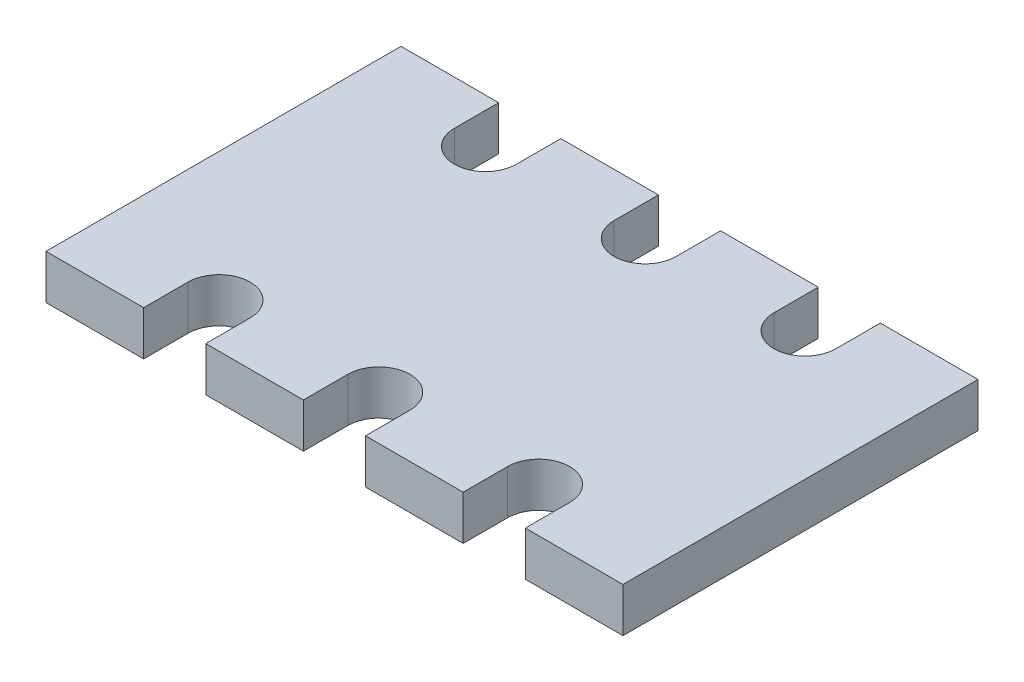
ISO-10303-21;
HEADER;
FILE_DESCRIPTION(('STEP AP214'),'2;1');
FILE_NAME('part.step','',(''),(''),'','','');
FILE_SCHEMA(('AUTOMOTIVE_DESIGN { 1 0 10303 214 1 1 1 1 }'));
ENDSEC;
DATA;
#1=APPLICATION_CONTEXT('core data for automotive mechanical design processes');
#2=APPLICATION_PROTOCOL_DEFINITION('international standard','automotive_design',2000,#1);
#3=PRODUCT_CONTEXT('',#1,'mechanical');
#4=PRODUCT('Part','Part','',(#3));
#5=PRODUCT_RELATED_PRODUCT_CATEGORY('part','',(#4));
#6=PRODUCT_DEFINITION_FORMATION('','',#4);
#7=PRODUCT_DEFINITION_CONTEXT('part definition',#1,'design');
#8=PRODUCT_DEFINITION('design','',#6,#7);
#9=PRODUCT_DEFINITION_SHAPE('','',#8);
#10=(LENGTH_UNIT() NAMED_UNIT(*) SI_UNIT(.MILLI.,.METRE.));
#11=(NAMED_UNIT(*) PLANE_ANGLE_UNIT() SI_UNIT($,.RADIAN.));
#12=(NAMED_UNIT(*) SI_UNIT($,.STERADIAN.) SOLID_ANGLE_UNIT());
#13=UNCERTAINTY_MEASURE_WITH_UNIT(LENGTH_MEASURE(1.E-05),#10,'distance_accuracy_value','');
#14=(GEOMETRIC_REPRESENTATION_CONTEXT(3) GLOBAL_UNCERTAINTY_ASSIGNED_CONTEXT((#13)) GLOBAL_UNIT_ASSIGNED_CONTEXT((#10,
#11,#12)) REPRESENTATION_CONTEXT('',''));
#15=CARTESIAN_POINT('',(0.,0.,0.));
#16=DIRECTION('',(0.,0.,1.));
#17=DIRECTION('',(1.,0.,0.));
#18=AXIS2_PLACEMENT_3D('',#15,#16,#17);
#19=CARTESIAN_POINT('',(0.,0.5,0.));
#20=DIRECTION('',(-1.,0.,0.));
#21=DIRECTION('',(0.,0.,1.));
#22=AXIS2_PLACEMENT_3D('',#19,#20,#21);
#23=PLANE('',#22);
#24=DIRECTION('',(0.,0.,-1.));
#25=VECTOR('',#24,1.);
#26=CARTESIAN_POINT('',(0.,0.,0.));
#27=LINE('',#26,#25);
#28=CARTESIAN_POINT('',(0.,0.,4.));
#29=VERTEX_POINT('',#28);
#30=CARTESIAN_POINT('',(0.,0.,0.));
#31=VERTEX_POINT('',#30);
#32=EDGE_CURVE('E252',#29,#31,#27,.T.);
#33=ORIENTED_EDGE('',*,*,#32,.T.);
#34=DIRECTION('',(0.,-1.,0.));
#35=VECTOR('',#34,1.);
#36=CARTESIAN_POINT('',(0.,0.5,0.));
#37=LINE('',#36,#35);
#38=CARTESIAN_POINT('',(0.,0.5,0.));
#39=VERTEX_POINT('',#38);
#40=EDGE_CURVE('E11',#39,#31,#37,.T.);
#41=ORIENTED_EDGE('',*,*,#40,.F.);
#42=DIRECTION('',(0.,0.,-1.));
#43=VECTOR('',#42,1.);
#44=CARTESIAN_POINT('',(0.,0.5,0.));
#45=LINE('',#44,#43);
#46=CARTESIAN_POINT('',(0.,0.5,4.));
#47=VERTEX_POINT('',#46);
#48=EDGE_CURVE('E306',#47,#39,#45,.T.);
#49=ORIENTED_EDGE('',*,*,#48,.F.);
#50=DIRECTION('',(0.,-1.,0.));
#51=VECTOR('',#50,1.);
#52=CARTESIAN_POINT('',(0.,0.5,4.));
#53=LINE('',#52,#51);
#54=EDGE_CURVE('E248',#47,#29,#53,.T.);
#55=ORIENTED_EDGE('',*,*,#54,.T.);
#56=EDGE_LOOP('',(#33,#41,#49,#55));
#57=FACE_BOUND('',#56,.T.);
#58=ADVANCED_FACE('F36',(#57),#23,.F.);
#59=CARTESIAN_POINT('',(0.,0.5,0.));
#60=DIRECTION('',(0.,0.,1.));
#61=DIRECTION('',(1.,0.,0.));
#62=AXIS2_PLACEMENT_3D('',#59,#60,#61);
#63=PLANE('',#62);
#64=DIRECTION('',(-1.,0.,0.));
#65=VECTOR('',#64,1.);
#66=CARTESIAN_POINT('',(0.,0.,0.));
#67=LINE('',#66,#65);
#68=CARTESIAN_POINT('',(-1.1,0.,0.));
#69=VERTEX_POINT('',#68);
#70=EDGE_CURVE('E255',#31,#69,#67,.T.);
#71=ORIENTED_EDGE('',*,*,#70,.T.);
#72=DIRECTION('',(0.,-1.,0.));
#73=VECTOR('',#72,1.);
#74=CARTESIAN_POINT('',(-1.1,0.5,0.));
#75=LINE('',#74,#73);
#76=CARTESIAN_POINT('',(-1.1,0.5,0.));
#77=VERTEX_POINT('',#76);
#78=EDGE_CURVE('E44',#77,#69,#75,.T.);
#79=ORIENTED_EDGE('',*,*,#78,.F.);
#80=DIRECTION('',(-1.,0.,0.));
#81=VECTOR('',#80,1.);
#82=CARTESIAN_POINT('',(0.,0.5,0.));
#83=LINE('',#82,#81);
#84=EDGE_CURVE('E155',#39,#77,#83,.T.);
#85=ORIENTED_EDGE('',*,*,#84,.F.);
#86=ORIENTED_EDGE('',*,*,#40,.T.);
#87=EDGE_LOOP('',(#71,#79,#85,#86));
#88=FACE_BOUND('',#87,.T.);
#89=ADVANCED_FACE('F464',(#88),#63,.F.);
#90=CARTESIAN_POINT('',(-1.1,0.5,0.5));
#91=DIRECTION('',(1.,0.,0.));
#92=DIRECTION('',(0.,0.,-1.));
#93=AXIS2_PLACEMENT_3D('',#90,#91,#92);
#94=PLANE('',#93);
#95=DIRECTION('',(0.,0.,1.));
#96=VECTOR('',#95,1.);
#97=CARTESIAN_POINT('',(-1.1,0.,0.5));
#98=LINE('',#97,#96);
#99=CARTESIAN_POINT('',(-1.1,0.,0.5));
#100=VERTEX_POINT('',#99);
#101=EDGE_CURVE('E257',#69,#100,#98,.T.);
#102=ORIENTED_EDGE('',*,*,#101,.T.);
#103=DIRECTION('',(0.,-1.,0.));
#104=VECTOR('',#103,1.);
#105=CARTESIAN_POINT('',(-1.1,0.5,0.5));
#106=LINE('',#105,#104);
#107=CARTESIAN_POINT('',(-1.1,0.5,0.5));
#108=VERTEX_POINT('',#107);
#109=EDGE_CURVE('E373',#108,#100,#106,.T.);
#110=ORIENTED_EDGE('',*,*,#109,.F.);
#111=DIRECTION('',(0.,0.,1.));
#112=VECTOR('',#111,1.);
#113=CARTESIAN_POINT('',(-1.1,0.5,0.5));
#114=LINE('',#113,#112);
#115=EDGE_CURVE('E381',#77,#108,#114,.T.);
#116=ORIENTED_EDGE('',*,*,#115,.F.);
#117=ORIENTED_EDGE('',*,*,#78,.T.);
#118=EDGE_LOOP('',(#102,#110,#116,#117));
#119=FACE_BOUND('',#118,.T.);
#120=ADVANCED_FACE('F379',(#119),#94,.F.);
#121=CARTESIAN_POINT('',(-1.45,0.5,0.5));
#122=DIRECTION('',(0.,-1.,0.));
#123=DIRECTION('',(0.,0.,-1.));
#124=AXIS2_PLACEMENT_3D('',#121,#122,#123);
#125=CYLINDRICAL_SURFACE('',#124,0.349999999999999);
#126=CARTESIAN_POINT('',(-1.45,0.,0.5));
#127=DIRECTION('',(0.,-1.,0.));
#128=DIRECTION('',(0.,0.,1.));
#129=AXIS2_PLACEMENT_3D('',#126,#127,#128);
#130=CIRCLE('',#129,0.349999999999999);
#131=CARTESIAN_POINT('',(-1.8,0.,0.5));
#132=VERTEX_POINT('',#131);
#133=EDGE_CURVE('E259',#100,#132,#130,.T.);
#134=ORIENTED_EDGE('',*,*,#133,.T.);
#135=DIRECTION('',(0.,-1.,0.));
#136=VECTOR('',#135,1.);
#137=CARTESIAN_POINT('',(-1.8,0.5,0.5));
#138=LINE('',#137,#136);
#139=CARTESIAN_POINT('',(-1.8,0.5,0.5));
#140=VERTEX_POINT('',#139);
#141=EDGE_CURVE('E370',#140,#132,#138,.T.);
#142=ORIENTED_EDGE('',*,*,#141,.F.);
#143=CARTESIAN_POINT('',(-1.45,0.5,0.5));
#144=DIRECTION('',(0.,-1.,0.));
#145=DIRECTION('',(0.,0.,1.));
#146=AXIS2_PLACEMENT_3D('',#143,#144,#145);
#147=CIRCLE('',#146,0.349999999999999);
#148=EDGE_CURVE('E399',#108,#140,#147,.T.);
#149=ORIENTED_EDGE('',*,*,#148,.F.);
#150=ORIENTED_EDGE('',*,*,#109,.T.);
#151=EDGE_LOOP('',(#134,#142,#149,#150));
#152=FACE_BOUND('',#151,.T.);
#153=ADVANCED_FACE('F390',(#152),#125,.F.);
#154=CARTESIAN_POINT('',(-1.8,0.5,0.));
#155=DIRECTION('',(-1.,0.,0.));
#156=DIRECTION('',(0.,0.,1.));
#157=AXIS2_PLACEMENT_3D('',#154,#155,#156);
#158=PLANE('',#157);
#159=DIRECTION('',(0.,0.,-1.));
#160=VECTOR('',#159,1.);
#161=CARTESIAN_POINT('',(-1.8,0.,0.));
#162=LINE('',#161,#160);
#163=CARTESIAN_POINT('',(-1.8,0.,0.));
#164=VERTEX_POINT('',#163);
#165=EDGE_CURVE('E261',#132,#164,#162,.T.);
#166=ORIENTED_EDGE('',*,*,#165,.T.);
#167=DIRECTION('',(0.,-1.,0.));
#168=VECTOR('',#167,1.);
#169=CARTESIAN_POINT('',(-1.8,0.5,0.));
#170=LINE('',#169,#168);
#171=CARTESIAN_POINT('',(-1.8,0.5,0.));
#172=VERTEX_POINT('',#171);
#173=EDGE_CURVE('E367',#172,#164,#170,.T.);
#174=ORIENTED_EDGE('',*,*,#173,.F.);
#175=DIRECTION('',(0.,0.,-1.));
#176=VECTOR('',#175,1.);
#177=CARTESIAN_POINT('',(-1.8,0.5,0.));
#178=LINE('',#177,#176);
#179=EDGE_CURVE('E396',#140,#172,#178,.T.);
#180=ORIENTED_EDGE('',*,*,#179,.F.);
#181=ORIENTED_EDGE('',*,*,#141,.T.);
#182=EDGE_LOOP('',(#166,#174,#180,#181));
#183=FACE_BOUND('',#182,.T.);
#184=ADVANCED_FACE('F394',(#183),#158,.F.);
#185=CARTESIAN_POINT('',(-2.9,0.5,0.));
#186=DIRECTION('',(0.,0.,1.));
#187=DIRECTION('',(1.,0.,0.));
#188=AXIS2_PLACEMENT_3D('',#185,#186,#187);
#189=PLANE('',#188);
#190=DIRECTION('',(-1.,0.,0.));
#191=VECTOR('',#190,1.);
#192=CARTESIAN_POINT('',(-2.9,0.,0.));
#193=LINE('',#192,#191);
#194=CARTESIAN_POINT('',(-2.9,0.,0.));
#195=VERTEX_POINT('',#194);
#196=EDGE_CURVE('E263',#164,#195,#193,.T.);
#197=ORIENTED_EDGE('',*,*,#196,.T.);
#198=DIRECTION('',(0.,-1.,0.));
#199=VECTOR('',#198,1.);
#200=CARTESIAN_POINT('',(-2.9,0.5,0.));
#201=LINE('',#200,#199);
#202=CARTESIAN_POINT('',(-2.9,0.5,0.));
#203=VERTEX_POINT('',#202);
#204=EDGE_CURVE('E364',#203,#195,#201,.T.);
#205=ORIENTED_EDGE('',*,*,#204,.F.);
#206=DIRECTION('',(-1.,0.,0.));
#207=VECTOR('',#206,1.);
#208=CARTESIAN_POINT('',(-2.9,0.5,0.));
#209=LINE('',#208,#207);
#210=EDGE_CURVE('E398',#172,#203,#209,.T.);
#211=ORIENTED_EDGE('',*,*,#210,.F.);
#212=ORIENTED_EDGE('',*,*,#173,.T.);
#213=EDGE_LOOP('',(#197,#205,#211,#212));
#214=FACE_BOUND('',#213,.T.);
#215=ADVANCED_FACE('F477',(#214),#189,.F.);
#216=CARTESIAN_POINT('',(-2.9,0.5,0.5));
#217=DIRECTION('',(1.,0.,0.));
#218=DIRECTION('',(0.,0.,-1.));
#219=AXIS2_PLACEMENT_3D('',#216,#217,#218);
#220=PLANE('',#219);
#221=DIRECTION('',(0.,0.,1.));
#222=VECTOR('',#221,1.);
#223=CARTESIAN_POINT('',(-2.9,0.,0.5));
#224=LINE('',#223,#222);
#225=CARTESIAN_POINT('',(-2.9,0.,0.5));
#226=VERTEX_POINT('',#225);
#227=EDGE_CURVE('E265',#195,#226,#224,.T.);
#228=ORIENTED_EDGE('',*,*,#227,.T.);
#229=DIRECTION('',(0.,-1.,0.));
#230=VECTOR('',#229,1.);
#231=CARTESIAN_POINT('',(-2.9,0.5,0.5));
#232=LINE('',#231,#230);
#233=CARTESIAN_POINT('',(-2.9,0.5,0.5));
#234=VERTEX_POINT('',#233);
#235=EDGE_CURVE('E361',#234,#226,#232,.T.);
#236=ORIENTED_EDGE('',*,*,#235,.F.);
#237=DIRECTION('',(0.,0.,1.));
#238=VECTOR('',#237,1.);
#239=CARTESIAN_POINT('',(-2.9,0.5,0.5));
#240=LINE('',#239,#238);
#241=EDGE_CURVE('E401',#203,#234,#240,.T.);
#242=ORIENTED_EDGE('',*,*,#241,.F.);
#243=ORIENTED_EDGE('',*,*,#204,.T.);
#244=EDGE_LOOP('',(#228,#236,#242,#243));
#245=FACE_BOUND('',#244,.T.);
#246=ADVANCED_FACE('F480',(#245),#220,.F.);
#247=CARTESIAN_POINT('',(-3.25,0.5,0.5));
#248=DIRECTION('',(0.,-1.,0.));
#249=DIRECTION('',(0.,0.,-1.));
#250=AXIS2_PLACEMENT_3D('',#247,#248,#249);
#251=CYLINDRICAL_SURFACE('',#250,0.35);
#252=CARTESIAN_POINT('',(-3.25,0.,0.5));
#253=DIRECTION('',(0.,-1.,0.));
#254=DIRECTION('',(0.,0.,-1.));
#255=AXIS2_PLACEMENT_3D('',#252,#253,#254);
#256=CIRCLE('',#255,0.35);
#257=CARTESIAN_POINT('',(-3.6,0.,0.5));
#258=VERTEX_POINT('',#257);
#259=EDGE_CURVE('E267',#226,#258,#256,.T.);
#260=ORIENTED_EDGE('',*,*,#259,.T.);
#261=DIRECTION('',(0.,-1.,0.));
#262=VECTOR('',#261,1.);
#263=CARTESIAN_POINT('',(-3.6,0.5,0.5));
#264=LINE('',#263,#262);
#265=CARTESIAN_POINT('',(-3.6,0.5,0.5));
#266=VERTEX_POINT('',#265);
#267=EDGE_CURVE('E358',#266,#258,#264,.T.);
#268=ORIENTED_EDGE('',*,*,#267,.F.);
#269=CARTESIAN_POINT('',(-3.25,0.5,0.5));
#270=DIRECTION('',(0.,-1.,0.));
#271=DIRECTION('',(0.,0.,-1.));
#272=AXIS2_PLACEMENT_3D('',#269,#270,#271);
#273=CIRCLE('',#272,0.35);
#274=EDGE_CURVE('E407',#234,#266,#273,.T.);
#275=ORIENTED_EDGE('',*,*,#274,.F.);
#276=ORIENTED_EDGE('',*,*,#235,.T.);
#277=EDGE_LOOP('',(#260,#268,#275,#276));
#278=FACE_BOUND('',#277,.T.);
#279=ADVANCED_FACE('F484',(#278),#251,.F.);
#280=CARTESIAN_POINT('',(-3.6,0.5,0.5));
#281=DIRECTION('',(-1.,0.,0.));
#282=DIRECTION('',(0.,0.,1.));
#283=AXIS2_PLACEMENT_3D('',#280,#281,#282);
#284=PLANE('',#283);
#285=DIRECTION('',(0.,0.,-1.));
#286=VECTOR('',#285,1.);
#287=CARTESIAN_POINT('',(-3.6,0.,0.5));
#288=LINE('',#287,#286);
#289=CARTESIAN_POINT('',(-3.6,0.,0.));
#290=VERTEX_POINT('',#289);
#291=EDGE_CURVE('E269',#258,#290,#288,.T.);
#292=ORIENTED_EDGE('',*,*,#291,.T.);
#293=DIRECTION('',(0.,-1.,0.));
#294=VECTOR('',#293,1.);
#295=CARTESIAN_POINT('',(-3.6,0.5,0.));
#296=LINE('',#295,#294);
#297=CARTESIAN_POINT('',(-3.6,0.5,0.));
#298=VERTEX_POINT('',#297);
#299=EDGE_CURVE('E355',#298,#290,#296,.T.);
#300=ORIENTED_EDGE('',*,*,#299,.F.);
#301=DIRECTION('',(0.,0.,-1.));
#302=VECTOR('',#301,1.);
#303=CARTESIAN_POINT('',(-3.6,0.5,0.5));
#304=LINE('',#303,#302);
#305=EDGE_CURVE('E409',#266,#298,#304,.T.);
#306=ORIENTED_EDGE('',*,*,#305,.F.);
#307=ORIENTED_EDGE('',*,*,#267,.T.);
#308=EDGE_LOOP('',(#292,#300,#306,#307));
#309=FACE_BOUND('',#308,.T.);
#310=ADVANCED_FACE('F488',(#309),#284,.F.);
#311=CARTESIAN_POINT('',(-3.6,0.5,0.));
#312=DIRECTION('',(0.,0.,1.));
#313=DIRECTION('',(1.,0.,0.));
#314=AXIS2_PLACEMENT_3D('',#311,#312,#313);
#315=PLANE('',#314);
#316=DIRECTION('',(-1.,0.,0.));
#317=VECTOR('',#316,1.);
#318=CARTESIAN_POINT('',(-3.6,0.,0.));
#319=LINE('',#318,#317);
#320=CARTESIAN_POINT('',(-4.7,0.,0.));
#321=VERTEX_POINT('',#320);
#322=EDGE_CURVE('E271',#290,#321,#319,.T.);
#323=ORIENTED_EDGE('',*,*,#322,.T.);
#324=DIRECTION('',(0.,-1.,0.));
#325=VECTOR('',#324,1.);
#326=CARTESIAN_POINT('',(-4.7,0.5,0.));
#327=LINE('',#326,#325);
#328=CARTESIAN_POINT('',(-4.7,0.5,0.));
#329=VERTEX_POINT('',#328);
#330=EDGE_CURVE('E352',#329,#321,#327,.T.);
#331=ORIENTED_EDGE('',*,*,#330,.F.);
#332=DIRECTION('',(-1.,0.,0.));
#333=VECTOR('',#332,1.);
#334=CARTESIAN_POINT('',(-3.6,0.5,0.));
#335=LINE('',#334,#333);
#336=EDGE_CURVE('E411',#298,#329,#335,.T.);
#337=ORIENTED_EDGE('',*,*,#336,.F.);
#338=ORIENTED_EDGE('',*,*,#299,.T.);
#339=EDGE_LOOP('',(#323,#331,#337,#338));
#340=FACE_BOUND('',#339,.T.);
#341=ADVANCED_FACE('F492',(#340),#315,.F.);
#342=CARTESIAN_POINT('',(-4.7,0.5,0.5));
#343=DIRECTION('',(1.,0.,0.));
#344=DIRECTION('',(0.,0.,-1.));
#345=AXIS2_PLACEMENT_3D('',#342,#343,#344);
#346=PLANE('',#345);
#347=DIRECTION('',(0.,0.,1.));
#348=VECTOR('',#347,1.);
#349=CARTESIAN_POINT('',(-4.7,0.,0.5));
#350=LINE('',#349,#348);
#351=CARTESIAN_POINT('',(-4.7,0.,0.5));
#352=VERTEX_POINT('',#351);
#353=EDGE_CURVE('E273',#321,#352,#350,.T.);
#354=ORIENTED_EDGE('',*,*,#353,.T.);
#355=DIRECTION('',(0.,-1.,0.));
#356=VECTOR('',#355,1.);
#357=CARTESIAN_POINT('',(-4.7,0.5,0.5));
#358=LINE('',#357,#356);
#359=CARTESIAN_POINT('',(-4.7,0.5,0.5));
#360=VERTEX_POINT('',#359);
#361=EDGE_CURVE('E349',#360,#352,#358,.T.);
#362=ORIENTED_EDGE('',*,*,#361,.F.);
#363=DIRECTION('',(0.,0.,1.));
#364=VECTOR('',#363,1.);
#365=CARTESIAN_POINT('',(-4.7,0.5,0.5));
#366=LINE('',#365,#364);
#367=EDGE_CURVE('E413',#329,#360,#366,.T.);
#368=ORIENTED_EDGE('',*,*,#367,.F.);
#369=ORIENTED_EDGE('',*,*,#330,.T.);
#370=EDGE_LOOP('',(#354,#362,#368,#369));
#371=FACE_BOUND('',#370,.T.);
#372=ADVANCED_FACE('F496',(#371),#346,.F.);
#373=CARTESIAN_POINT('',(-5.05,0.5,0.5));
#374=DIRECTION('',(0.,-1.,0.));
#375=DIRECTION('',(0.,0.,-1.));
#376=AXIS2_PLACEMENT_3D('',#373,#374,#375);
#377=CYLINDRICAL_SURFACE('',#376,0.35);
#378=CARTESIAN_POINT('',(-5.05,0.,0.5));
#379=DIRECTION('',(0.,-1.,0.));
#380=DIRECTION('',(0.,0.,1.));
#381=AXIS2_PLACEMENT_3D('',#378,#379,#380);
#382=CIRCLE('',#381,0.35);
#383=CARTESIAN_POINT('',(-5.4,0.,0.5));
#384=VERTEX_POINT('',#383);
#385=EDGE_CURVE('E275',#352,#384,#382,.T.);
#386=ORIENTED_EDGE('',*,*,#385,.T.);
#387=DIRECTION('',(0.,-1.,0.));
#388=VECTOR('',#387,1.);
#389=CARTESIAN_POINT('',(-5.4,0.5,0.5));
#390=LINE('',#389,#388);
#391=CARTESIAN_POINT('',(-5.4,0.5,0.5));
#392=VERTEX_POINT('',#391);
#393=EDGE_CURVE('E346',#392,#384,#390,.T.);
#394=ORIENTED_EDGE('',*,*,#393,.F.);
#395=CARTESIAN_POINT('',(-5.05,0.5,0.5));
#396=DIRECTION('',(0.,-1.,0.));
#397=DIRECTION('',(0.,0.,1.));
#398=AXIS2_PLACEMENT_3D('',#395,#396,#397);
#399=CIRCLE('',#398,0.35);
#400=EDGE_CURVE('E415',#360,#392,#399,.T.);
#401=ORIENTED_EDGE('',*,*,#400,.F.);
#402=ORIENTED_EDGE('',*,*,#361,.T.);
#403=EDGE_LOOP('',(#386,#394,#401,#402));
#404=FACE_BOUND('',#403,.T.);
#405=ADVANCED_FACE('F500',(#404),#377,.F.);
#406=CARTESIAN_POINT('',(-5.4,0.5,0.));
#407=DIRECTION('',(-1.,0.,0.));
#408=DIRECTION('',(0.,0.,1.));
#409=AXIS2_PLACEMENT_3D('',#406,#407,#408);
#410=PLANE('',#409);
#411=DIRECTION('',(0.,0.,-1.));
#412=VECTOR('',#411,1.);
#413=CARTESIAN_POINT('',(-5.4,0.,0.));
#414=LINE('',#413,#412);
#415=CARTESIAN_POINT('',(-5.4,0.,0.));
#416=VERTEX_POINT('',#415);
#417=EDGE_CURVE('E277',#384,#416,#414,.T.);
#418=ORIENTED_EDGE('',*,*,#417,.T.);
#419=DIRECTION('',(0.,-1.,0.));
#420=VECTOR('',#419,1.);
#421=CARTESIAN_POINT('',(-5.4,0.5,0.));
#422=LINE('',#421,#420);
#423=CARTESIAN_POINT('',(-5.4,0.5,0.));
#424=VERTEX_POINT('',#423);
#425=EDGE_CURVE('E343',#424,#416,#422,.T.);
#426=ORIENTED_EDGE('',*,*,#425,.F.);
#427=DIRECTION('',(0.,0.,-1.));
#428=VECTOR('',#427,1.);
#429=CARTESIAN_POINT('',(-5.4,0.5,0.));
#430=LINE('',#429,#428);
#431=EDGE_CURVE('E417',#392,#424,#430,.T.);
#432=ORIENTED_EDGE('',*,*,#431,.F.);
#433=ORIENTED_EDGE('',*,*,#393,.T.);
#434=EDGE_LOOP('',(#418,#426,#432,#433));
#435=FACE_BOUND('',#434,.T.);
#436=ADVANCED_FACE('F504',(#435),#410,.F.);
#437=CARTESIAN_POINT('',(-5.4,0.5,0.));
#438=DIRECTION('',(0.,0.,1.));
#439=DIRECTION('',(1.,0.,0.));
#440=AXIS2_PLACEMENT_3D('',#437,#438,#439);
#441=PLANE('',#440);
#442=DIRECTION('',(-1.,0.,0.));
#443=VECTOR('',#442,1.);
#444=CARTESIAN_POINT('',(-5.4,0.,0.));
#445=LINE('',#444,#443);
#446=CARTESIAN_POINT('',(-6.5,0.,0.));
#447=VERTEX_POINT('',#446);
#448=EDGE_CURVE('E279',#416,#447,#445,.T.);
#449=ORIENTED_EDGE('',*,*,#448,.T.);
#450=DIRECTION('',(0.,-1.,0.));
#451=VECTOR('',#450,1.);
#452=CARTESIAN_POINT('',(-6.5,0.5,0.));
#453=LINE('',#452,#451);
#454=CARTESIAN_POINT('',(-6.5,0.5,0.));
#455=VERTEX_POINT('',#454);
#456=EDGE_CURVE('E340',#455,#447,#453,.T.);
#457=ORIENTED_EDGE('',*,*,#456,.F.);
#458=DIRECTION('',(-1.,0.,0.));
#459=VECTOR('',#458,1.);
#460=CARTESIAN_POINT('',(-5.4,0.5,0.));
#461=LINE('',#460,#459);
#462=EDGE_CURVE('E419',#424,#455,#461,.T.);
#463=ORIENTED_EDGE('',*,*,#462,.F.);
#464=ORIENTED_EDGE('',*,*,#425,.T.);
#465=EDGE_LOOP('',(#449,#457,#463,#464));
#466=FACE_BOUND('',#465,.T.);
#467=ADVANCED_FACE('F508',(#466),#441,.F.);
#468=CARTESIAN_POINT('',(-6.5,0.5,0.));
#469=DIRECTION('',(1.,0.,0.));
#470=DIRECTION('',(0.,0.,-1.));
#471=AXIS2_PLACEMENT_3D('',#468,#469,#470);
#472=PLANE('',#471);
#473=DIRECTION('',(0.,0.,1.));
#474=VECTOR('',#473,1.);
#475=CARTESIAN_POINT('',(-6.5,0.,0.));
#476=LINE('',#475,#474);
#477=CARTESIAN_POINT('',(-6.5,0.,4.));
#478=VERTEX_POINT('',#477);
#479=EDGE_CURVE('E281',#447,#478,#476,.T.);
#480=ORIENTED_EDGE('',*,*,#479,.T.);
#481=DIRECTION('',(0.,-1.,0.));
#482=VECTOR('',#481,1.);
#483=CARTESIAN_POINT('',(-6.5,0.5,4.));
#484=LINE('',#483,#482);
#485=CARTESIAN_POINT('',(-6.5,0.5,4.));
#486=VERTEX_POINT('',#485);
#487=EDGE_CURVE('E337',#486,#478,#484,.T.);
#488=ORIENTED_EDGE('',*,*,#487,.F.);
#489=DIRECTION('',(0.,0.,1.));
#490=VECTOR('',#489,1.);
#491=CARTESIAN_POINT('',(-6.5,0.5,0.));
#492=LINE('',#491,#490);
#493=EDGE_CURVE('E421',#455,#486,#492,.T.);
#494=ORIENTED_EDGE('',*,*,#493,.F.);
#495=ORIENTED_EDGE('',*,*,#456,.T.);
#496=EDGE_LOOP('',(#480,#488,#494,#495));
#497=FACE_BOUND('',#496,.T.);
#498=ADVANCED_FACE('F512',(#497),#472,.F.);
#499=CARTESIAN_POINT('',(-5.4,0.5,4.));
#500=DIRECTION('',(0.,0.,-1.));
#501=DIRECTION('',(-1.,0.,0.));
#502=AXIS2_PLACEMENT_3D('',#499,#500,#501);
#503=PLANE('',#502);
#504=DIRECTION('',(1.,0.,0.));
#505=VECTOR('',#504,1.);
#506=CARTESIAN_POINT('',(-5.4,0.,4.));
#507=LINE('',#506,#505);
#508=CARTESIAN_POINT('',(-5.4,0.,4.));
#509=VERTEX_POINT('',#508);
#510=EDGE_CURVE('E283',#478,#509,#507,.T.);
#511=ORIENTED_EDGE('',*,*,#510,.T.);
#512=DIRECTION('',(0.,-1.,0.));
#513=VECTOR('',#512,1.);
#514=CARTESIAN_POINT('',(-5.4,0.5,4.));
#515=LINE('',#514,#513);
#516=CARTESIAN_POINT('',(-5.4,0.5,4.));
#517=VERTEX_POINT('',#516);
#518=EDGE_CURVE('E334',#517,#509,#515,.T.);
#519=ORIENTED_EDGE('',*,*,#518,.F.);
#520=DIRECTION('',(1.,0.,0.));
#521=VECTOR('',#520,1.);
#522=CARTESIAN_POINT('',(-5.4,0.5,4.));
#523=LINE('',#522,#521);
#524=EDGE_CURVE('E423',#486,#517,#523,.T.);
#525=ORIENTED_EDGE('',*,*,#524,.F.);
#526=ORIENTED_EDGE('',*,*,#487,.T.);
#527=EDGE_LOOP('',(#511,#519,#525,#526));
#528=FACE_BOUND('',#527,.T.);
#529=ADVANCED_FACE('F516',(#528),#503,.F.);
#530=CARTESIAN_POINT('',(-5.4,0.5,4.));
#531=DIRECTION('',(-1.,0.,0.));
#532=DIRECTION('',(0.,0.,1.));
#533=AXIS2_PLACEMENT_3D('',#530,#531,#532);
#534=PLANE('',#533);
#535=DIRECTION('',(0.,0.,-1.));
#536=VECTOR('',#535,1.);
#537=CARTESIAN_POINT('',(-5.4,0.,4.));
#538=LINE('',#537,#536);
#539=CARTESIAN_POINT('',(-5.4,0.,3.5));
#540=VERTEX_POINT('',#539);
#541=EDGE_CURVE('E285',#509,#540,#538,.T.);
#542=ORIENTED_EDGE('',*,*,#541,.T.);
#543=DIRECTION('',(0.,-1.,0.));
#544=VECTOR('',#543,1.);
#545=CARTESIAN_POINT('',(-5.4,0.5,3.5));
#546=LINE('',#545,#544);
#547=CARTESIAN_POINT('',(-5.4,0.5,3.5));
#548=VERTEX_POINT('',#547);
#549=EDGE_CURVE('E331',#548,#540,#546,.T.);
#550=ORIENTED_EDGE('',*,*,#549,.F.);
#551=DIRECTION('',(0.,0.,-1.));
#552=VECTOR('',#551,1.);
#553=CARTESIAN_POINT('',(-5.4,0.5,4.));
#554=LINE('',#553,#552);
#555=EDGE_CURVE('E425',#517,#548,#554,.T.);
#556=ORIENTED_EDGE('',*,*,#555,.F.);
#557=ORIENTED_EDGE('',*,*,#518,.T.);
#558=EDGE_LOOP('',(#542,#550,#556,#557));
#559=FACE_BOUND('',#558,.T.);
#560=ADVANCED_FACE('F520',(#559),#534,.F.);
#561=CARTESIAN_POINT('',(-5.05,0.5,3.5));
#562=DIRECTION('',(0.,-1.,0.));
#563=DIRECTION('',(0.,0.,-1.));
#564=AXIS2_PLACEMENT_3D('',#561,#562,#563);
#565=CYLINDRICAL_SURFACE('',#564,0.35);
#566=CARTESIAN_POINT('',(-5.05,0.,3.5));
#567=DIRECTION('',(0.,-1.,0.));
#568=DIRECTION('',(0.,0.,-1.));
#569=AXIS2_PLACEMENT_3D('',#566,#567,#568);
#570=CIRCLE('',#569,0.35);
#571=CARTESIAN_POINT('',(-4.7,0.,3.5));
#572=VERTEX_POINT('',#571);
#573=EDGE_CURVE('E287',#540,#572,#570,.T.);
#574=ORIENTED_EDGE('',*,*,#573,.T.);
#575=DIRECTION('',(0.,-1.,0.));
#576=VECTOR('',#575,1.);
#577=CARTESIAN_POINT('',(-4.7,0.5,3.5));
#578=LINE('',#577,#576);
#579=CARTESIAN_POINT('',(-4.7,0.5,3.5));
#580=VERTEX_POINT('',#579);
#581=EDGE_CURVE('E328',#580,#572,#578,.T.);
#582=ORIENTED_EDGE('',*,*,#581,.F.);
#583=CARTESIAN_POINT('',(-5.05,0.5,3.5));
#584=DIRECTION('',(0.,-1.,0.));
#585=DIRECTION('',(0.,0.,-1.));
#586=AXIS2_PLACEMENT_3D('',#583,#584,#585);
#587=CIRCLE('',#586,0.35);
#588=EDGE_CURVE('E427',#548,#580,#587,.T.);
#589=ORIENTED_EDGE('',*,*,#588,.F.);
#590=ORIENTED_EDGE('',*,*,#549,.T.);
#591=EDGE_LOOP('',(#574,#582,#589,#590));
#592=FACE_BOUND('',#591,.T.);
#593=ADVANCED_FACE('F524',(#592),#565,.F.);
#594=CARTESIAN_POINT('',(-4.7,0.5,3.5));
#595=DIRECTION('',(1.,0.,0.));
#596=DIRECTION('',(0.,0.,-1.));
#597=AXIS2_PLACEMENT_3D('',#594,#595,#596);
#598=PLANE('',#597);
#599=DIRECTION('',(0.,0.,1.));
#600=VECTOR('',#599,1.);
#601=CARTESIAN_POINT('',(-4.7,0.,3.5));
#602=LINE('',#601,#600);
#603=CARTESIAN_POINT('',(-4.7,0.,4.));
#604=VERTEX_POINT('',#603);
#605=EDGE_CURVE('E289',#572,#604,#602,.T.);
#606=ORIENTED_EDGE('',*,*,#605,.T.);
#607=DIRECTION('',(0.,-1.,0.));
#608=VECTOR('',#607,1.);
#609=CARTESIAN_POINT('',(-4.7,0.5,4.));
#610=LINE('',#609,#608);
#611=CARTESIAN_POINT('',(-4.7,0.5,4.));
#612=VERTEX_POINT('',#611);
#613=EDGE_CURVE('E325',#612,#604,#610,.T.);
#614=ORIENTED_EDGE('',*,*,#613,.F.);
#615=DIRECTION('',(0.,0.,1.));
#616=VECTOR('',#615,1.);
#617=CARTESIAN_POINT('',(-4.7,0.5,3.5));
#618=LINE('',#617,#616);
#619=EDGE_CURVE('E429',#580,#612,#618,.T.);
#620=ORIENTED_EDGE('',*,*,#619,.F.);
#621=ORIENTED_EDGE('',*,*,#581,.T.);
#622=EDGE_LOOP('',(#606,#614,#620,#621));
#623=FACE_BOUND('',#622,.T.);
#624=ADVANCED_FACE('F528',(#623),#598,.F.);
#625=CARTESIAN_POINT('',(-3.6,0.5,4.));
#626=DIRECTION('',(0.,0.,-1.));
#627=DIRECTION('',(-1.,0.,0.));
#628=AXIS2_PLACEMENT_3D('',#625,#626,#627);
#629=PLANE('',#628);
#630=DIRECTION('',(1.,0.,0.));
#631=VECTOR('',#630,1.);
#632=CARTESIAN_POINT('',(-3.6,0.,4.));
#633=LINE('',#632,#631);
#634=CARTESIAN_POINT('',(-3.6,0.,4.));
#635=VERTEX_POINT('',#634);
#636=EDGE_CURVE('E291',#604,#635,#633,.T.);
#637=ORIENTED_EDGE('',*,*,#636,.T.);
#638=DIRECTION('',(0.,-1.,0.));
#639=VECTOR('',#638,1.);
#640=CARTESIAN_POINT('',(-3.6,0.5,4.));
#641=LINE('',#640,#639);
#642=CARTESIAN_POINT('',(-3.6,0.5,4.));
#643=VERTEX_POINT('',#642);
#644=EDGE_CURVE('E322',#643,#635,#641,.T.);
#645=ORIENTED_EDGE('',*,*,#644,.F.);
#646=DIRECTION('',(1.,0.,0.));
#647=VECTOR('',#646,1.);
#648=CARTESIAN_POINT('',(-3.6,0.5,4.));
#649=LINE('',#648,#647);
#650=EDGE_CURVE('E431',#612,#643,#649,.T.);
#651=ORIENTED_EDGE('',*,*,#650,.F.);
#652=ORIENTED_EDGE('',*,*,#613,.T.);
#653=EDGE_LOOP('',(#637,#645,#651,#652));
#654=FACE_BOUND('',#653,.T.);
#655=ADVANCED_FACE('F532',(#654),#629,.F.);
#656=CARTESIAN_POINT('',(-3.6,0.5,4.));
#657=DIRECTION('',(-1.,0.,0.));
#658=DIRECTION('',(0.,0.,1.));
#659=AXIS2_PLACEMENT_3D('',#656,#657,#658);
#660=PLANE('',#659);
#661=DIRECTION('',(0.,0.,-1.));
#662=VECTOR('',#661,1.);
#663=CARTESIAN_POINT('',(-3.6,0.,4.));
#664=LINE('',#663,#662);
#665=CARTESIAN_POINT('',(-3.6,0.,3.5));
#666=VERTEX_POINT('',#665);
#667=EDGE_CURVE('E293',#635,#666,#664,.T.);
#668=ORIENTED_EDGE('',*,*,#667,.T.);
#669=DIRECTION('',(0.,-1.,0.));
#670=VECTOR('',#669,1.);
#671=CARTESIAN_POINT('',(-3.6,0.5,3.5));
#672=LINE('',#671,#670);
#673=CARTESIAN_POINT('',(-3.6,0.5,3.5));
#674=VERTEX_POINT('',#673);
#675=EDGE_CURVE('E319',#674,#666,#672,.T.);
#676=ORIENTED_EDGE('',*,*,#675,.F.);
#677=DIRECTION('',(0.,0.,-1.));
#678=VECTOR('',#677,1.);
#679=CARTESIAN_POINT('',(-3.6,0.5,4.));
#680=LINE('',#679,#678);
#681=EDGE_CURVE('E433',#643,#674,#680,.T.);
#682=ORIENTED_EDGE('',*,*,#681,.F.);
#683=ORIENTED_EDGE('',*,*,#644,.T.);
#684=EDGE_LOOP('',(#668,#676,#682,#683));
#685=FACE_BOUND('',#684,.T.);
#686=ADVANCED_FACE('F536',(#685),#660,.F.);
#687=CARTESIAN_POINT('',(-3.25,0.5,3.5));
#688=DIRECTION('',(0.,-1.,0.));
#689=DIRECTION('',(0.,0.,-1.));
#690=AXIS2_PLACEMENT_3D('',#687,#688,#689);
#691=CYLINDRICAL_SURFACE('',#690,0.35);
#692=CARTESIAN_POINT('',(-3.25,0.,3.5));
#693=DIRECTION('',(0.,-1.,0.));
#694=DIRECTION('',(0.,0.,1.));
#695=AXIS2_PLACEMENT_3D('',#692,#693,#694);
#696=CIRCLE('',#695,0.35);
#697=CARTESIAN_POINT('',(-2.9,0.,3.5));
#698=VERTEX_POINT('',#697);
#699=EDGE_CURVE('E295',#666,#698,#696,.T.);
#700=ORIENTED_EDGE('',*,*,#699,.T.);
#701=DIRECTION('',(0.,-1.,0.));
#702=VECTOR('',#701,1.);
#703=CARTESIAN_POINT('',(-2.9,0.5,3.5));
#704=LINE('',#703,#702);
#705=CARTESIAN_POINT('',(-2.9,0.5,3.5));
#706=VERTEX_POINT('',#705);
#707=EDGE_CURVE('E316',#706,#698,#704,.T.);
#708=ORIENTED_EDGE('',*,*,#707,.F.);
#709=CARTESIAN_POINT('',(-3.25,0.5,3.5));
#710=DIRECTION('',(0.,-1.,0.));
#711=DIRECTION('',(0.,0.,1.));
#712=AXIS2_PLACEMENT_3D('',#709,#710,#711);
#713=CIRCLE('',#712,0.35);
#714=EDGE_CURVE('E435',#674,#706,#713,.T.);
#715=ORIENTED_EDGE('',*,*,#714,.F.);
#716=ORIENTED_EDGE('',*,*,#675,.T.);
#717=EDGE_LOOP('',(#700,#708,#715,#716));
#718=FACE_BOUND('',#717,.T.);
#719=ADVANCED_FACE('F540',(#718),#691,.F.);
#720=CARTESIAN_POINT('',(-2.9,0.5,3.5));
#721=DIRECTION('',(1.,0.,0.));
#722=DIRECTION('',(0.,0.,-1.));
#723=AXIS2_PLACEMENT_3D('',#720,#721,#722);
#724=PLANE('',#723);
#725=DIRECTION('',(0.,0.,1.));
#726=VECTOR('',#725,1.);
#727=CARTESIAN_POINT('',(-2.9,0.,3.5));
#728=LINE('',#727,#726);
#729=CARTESIAN_POINT('',(-2.9,0.,4.));
#730=VERTEX_POINT('',#729);
#731=EDGE_CURVE('E297',#698,#730,#728,.T.);
#732=ORIENTED_EDGE('',*,*,#731,.T.);
#733=DIRECTION('',(0.,-1.,0.));
#734=VECTOR('',#733,1.);
#735=CARTESIAN_POINT('',(-2.9,0.5,4.));
#736=LINE('',#735,#734);
#737=CARTESIAN_POINT('',(-2.9,0.5,4.));
#738=VERTEX_POINT('',#737);
#739=EDGE_CURVE('E313',#738,#730,#736,.T.);
#740=ORIENTED_EDGE('',*,*,#739,.F.);
#741=DIRECTION('',(0.,0.,1.));
#742=VECTOR('',#741,1.);
#743=CARTESIAN_POINT('',(-2.9,0.5,3.5));
#744=LINE('',#743,#742);
#745=EDGE_CURVE('E437',#706,#738,#744,.T.);
#746=ORIENTED_EDGE('',*,*,#745,.F.);
#747=ORIENTED_EDGE('',*,*,#707,.T.);
#748=EDGE_LOOP('',(#732,#740,#746,#747));
#749=FACE_BOUND('',#748,.T.);
#750=ADVANCED_FACE('F544',(#749),#724,.F.);
#751=CARTESIAN_POINT('',(-2.9,0.5,4.));
#752=DIRECTION('',(0.,0.,-1.));
#753=DIRECTION('',(-1.,0.,0.));
#754=AXIS2_PLACEMENT_3D('',#751,#752,#753);
#755=PLANE('',#754);
#756=DIRECTION('',(1.,0.,0.));
#757=VECTOR('',#756,1.);
#758=CARTESIAN_POINT('',(-2.9,0.,4.));
#759=LINE('',#758,#757);
#760=CARTESIAN_POINT('',(-1.8,0.,4.));
#761=VERTEX_POINT('',#760);
#762=EDGE_CURVE('E299',#730,#761,#759,.T.);
#763=ORIENTED_EDGE('',*,*,#762,.T.);
#764=DIRECTION('',(0.,-1.,0.));
#765=VECTOR('',#764,1.);
#766=CARTESIAN_POINT('',(-1.8,0.5,4.));
#767=LINE('',#766,#765);
#768=CARTESIAN_POINT('',(-1.8,0.5,4.));
#769=VERTEX_POINT('',#768);
#770=EDGE_CURVE('E310',#769,#761,#767,.T.);
#771=ORIENTED_EDGE('',*,*,#770,.F.);
#772=DIRECTION('',(1.,0.,0.));
#773=VECTOR('',#772,1.);
#774=CARTESIAN_POINT('',(-2.9,0.5,4.));
#775=LINE('',#774,#773);
#776=EDGE_CURVE('E439',#738,#769,#775,.T.);
#777=ORIENTED_EDGE('',*,*,#776,.F.);
#778=ORIENTED_EDGE('',*,*,#739,.T.);
#779=EDGE_LOOP('',(#763,#771,#777,#778));
#780=FACE_BOUND('',#779,.T.);
#781=ADVANCED_FACE('F445',(#780),#755,.F.);
#782=CARTESIAN_POINT('',(-1.8,0.5,4.));
#783=DIRECTION('',(-1.,0.,0.));
#784=DIRECTION('',(0.,0.,1.));
#785=AXIS2_PLACEMENT_3D('',#782,#783,#784);
#786=PLANE('',#785);
#787=DIRECTION('',(0.,0.,-1.));
#788=VECTOR('',#787,1.);
#789=CARTESIAN_POINT('',(-1.8,0.,4.));
#790=LINE('',#789,#788);
#791=CARTESIAN_POINT('',(-1.8,0.,3.5));
#792=VERTEX_POINT('',#791);
#793=EDGE_CURVE('E301',#761,#792,#790,.T.);
#794=ORIENTED_EDGE('',*,*,#793,.T.);
#795=DIRECTION('',(0.,-1.,0.));
#796=VECTOR('',#795,1.);
#797=CARTESIAN_POINT('',(-1.8,0.5,3.5));
#798=LINE('',#797,#796);
#799=CARTESIAN_POINT('',(-1.8,0.5,3.5));
#800=VERTEX_POINT('',#799);
#801=EDGE_CURVE('E243',#800,#792,#798,.T.);
#802=ORIENTED_EDGE('',*,*,#801,.F.);
#803=DIRECTION('',(0.,0.,-1.));
#804=VECTOR('',#803,1.);
#805=CARTESIAN_POINT('',(-1.8,0.5,4.));
#806=LINE('',#805,#804);
#807=EDGE_CURVE('E234',#769,#800,#806,.T.);
#808=ORIENTED_EDGE('',*,*,#807,.F.);
#809=ORIENTED_EDGE('',*,*,#770,.T.);
#810=EDGE_LOOP('',(#794,#802,#808,#809));
#811=FACE_BOUND('',#810,.T.);
#812=ADVANCED_FACE('F449',(#811),#786,.F.);
#813=CARTESIAN_POINT('',(-1.45,0.5,3.5));
#814=DIRECTION('',(0.,-1.,0.));
#815=DIRECTION('',(0.,0.,-1.));
#816=AXIS2_PLACEMENT_3D('',#813,#814,#815);
#817=CYLINDRICAL_SURFACE('',#816,0.35);
#818=CARTESIAN_POINT('',(-1.45,0.,3.5));
#819=DIRECTION('',(0.,-1.,0.));
#820=DIRECTION('',(0.,0.,1.));
#821=AXIS2_PLACEMENT_3D('',#818,#819,#820);
#822=CIRCLE('',#821,0.35);
#823=CARTESIAN_POINT('',(-1.1,0.,3.5));
#824=VERTEX_POINT('',#823);
#825=EDGE_CURVE('E242',#792,#824,#822,.T.);
#826=ORIENTED_EDGE('',*,*,#825,.T.);
#827=DIRECTION('',(0.,-1.,0.));
#828=VECTOR('',#827,1.);
#829=CARTESIAN_POINT('',(-1.1,0.5,3.5));
#830=LINE('',#829,#828);
#831=CARTESIAN_POINT('',(-1.1,0.5,3.5));
#832=VERTEX_POINT('',#831);
#833=EDGE_CURVE('E239',#832,#824,#830,.T.);
#834=ORIENTED_EDGE('',*,*,#833,.F.);
#835=CARTESIAN_POINT('',(-1.45,0.5,3.5));
#836=DIRECTION('',(0.,-1.,0.));
#837=DIRECTION('',(0.,0.,1.));
#838=AXIS2_PLACEMENT_3D('',#835,#836,#837);
#839=CIRCLE('',#838,0.35);
#840=EDGE_CURVE('E228',#800,#832,#839,.T.);
#841=ORIENTED_EDGE('',*,*,#840,.F.);
#842=ORIENTED_EDGE('',*,*,#801,.T.);
#843=EDGE_LOOP('',(#826,#834,#841,#842));
#844=FACE_BOUND('',#843,.T.);
#845=ADVANCED_FACE('F240',(#844),#817,.F.);
#846=CARTESIAN_POINT('',(-1.1,0.5,3.5));
#847=DIRECTION('',(1.,0.,0.));
#848=DIRECTION('',(0.,0.,-1.));
#849=AXIS2_PLACEMENT_3D('',#846,#847,#848);
#850=PLANE('',#849);
#851=DIRECTION('',(0.,0.,1.));
#852=VECTOR('',#851,1.);
#853=CARTESIAN_POINT('',(-1.1,0.,3.5));
#854=LINE('',#853,#852);
#855=CARTESIAN_POINT('',(-1.1,0.,4.));
#856=VERTEX_POINT('',#855);
#857=EDGE_CURVE('E141',#824,#856,#854,.T.);
#858=ORIENTED_EDGE('',*,*,#857,.T.);
#859=DIRECTION('',(0.,-1.,0.));
#860=VECTOR('',#859,1.);
#861=CARTESIAN_POINT('',(-1.1,0.5,4.));
#862=LINE('',#861,#860);
#863=CARTESIAN_POINT('',(-1.1,0.5,4.));
#864=VERTEX_POINT('',#863);
#865=EDGE_CURVE('E244',#864,#856,#862,.T.);
#866=ORIENTED_EDGE('',*,*,#865,.F.);
#867=DIRECTION('',(0.,0.,1.));
#868=VECTOR('',#867,1.);
#869=CARTESIAN_POINT('',(-1.1,0.5,3.5));
#870=LINE('',#869,#868);
#871=EDGE_CURVE('E232',#832,#864,#870,.T.);
#872=ORIENTED_EDGE('',*,*,#871,.F.);
#873=ORIENTED_EDGE('',*,*,#833,.T.);
#874=EDGE_LOOP('',(#858,#866,#872,#873));
#875=FACE_BOUND('',#874,.T.);
#876=ADVANCED_FACE('F246',(#875),#850,.F.);
#877=CARTESIAN_POINT('',(0.,0.5,4.));
#878=DIRECTION('',(0.,0.,-1.));
#879=DIRECTION('',(-1.,0.,0.));
#880=AXIS2_PLACEMENT_3D('',#877,#878,#879);
#881=PLANE('',#880);
#882=DIRECTION('',(1.,0.,0.));
#883=VECTOR('',#882,1.);
#884=CARTESIAN_POINT('',(0.,0.,4.));
#885=LINE('',#884,#883);
#886=EDGE_CURVE('E147',#856,#29,#885,.T.);
#887=ORIENTED_EDGE('',*,*,#886,.T.);
#888=ORIENTED_EDGE('',*,*,#54,.F.);
#889=DIRECTION('',(1.,0.,0.));
#890=VECTOR('',#889,1.);
#891=CARTESIAN_POINT('',(0.,0.5,4.));
#892=LINE('',#891,#890);
#893=EDGE_CURVE('E52',#864,#47,#892,.T.);
#894=ORIENTED_EDGE('',*,*,#893,.F.);
#895=ORIENTED_EDGE('',*,*,#865,.T.);
#896=EDGE_LOOP('',(#887,#888,#894,#895));
#897=FACE_BOUND('',#896,.T.);
#898=ADVANCED_FACE('F453',(#897),#881,.F.);
#899=CARTESIAN_POINT('',(-1.45,0.5,3.5));
#900=DIRECTION('',(0.,1.,0.));
#901=DIRECTION('',(0.,0.,1.));
#902=AXIS2_PLACEMENT_3D('',#899,#900,#901);
#903=PLANE('',#902);
#904=ORIENTED_EDGE('',*,*,#48,.T.);
#905=ORIENTED_EDGE('',*,*,#84,.T.);
#906=ORIENTED_EDGE('',*,*,#115,.T.);
#907=ORIENTED_EDGE('',*,*,#148,.T.);
#908=ORIENTED_EDGE('',*,*,#179,.T.);
#909=ORIENTED_EDGE('',*,*,#210,.T.);
#910=ORIENTED_EDGE('',*,*,#241,.T.);
#911=ORIENTED_EDGE('',*,*,#274,.T.);
#912=ORIENTED_EDGE('',*,*,#305,.T.);
#913=ORIENTED_EDGE('',*,*,#336,.T.);
#914=ORIENTED_EDGE('',*,*,#367,.T.);
#915=ORIENTED_EDGE('',*,*,#400,.T.);
#916=ORIENTED_EDGE('',*,*,#431,.T.);
#917=ORIENTED_EDGE('',*,*,#462,.T.);
#918=ORIENTED_EDGE('',*,*,#493,.T.);
#919=ORIENTED_EDGE('',*,*,#524,.T.);
#920=ORIENTED_EDGE('',*,*,#555,.T.);
#921=ORIENTED_EDGE('',*,*,#588,.T.);
#922=ORIENTED_EDGE('',*,*,#619,.T.);
#923=ORIENTED_EDGE('',*,*,#650,.T.);
#924=ORIENTED_EDGE('',*,*,#681,.T.);
#925=ORIENTED_EDGE('',*,*,#714,.T.);
#926=ORIENTED_EDGE('',*,*,#745,.T.);
#927=ORIENTED_EDGE('',*,*,#776,.T.);
#928=ORIENTED_EDGE('',*,*,#807,.T.);
#929=ORIENTED_EDGE('',*,*,#840,.T.);
#930=ORIENTED_EDGE('',*,*,#871,.T.);
#931=ORIENTED_EDGE('',*,*,#893,.T.);
#932=EDGE_LOOP('',(#904,#905,#906,#907,#908,#909,#910,#911,#912,#913,#914,#915,#916,#917,#918,
#919,#920,#921,#922,#923,#924,#925,#926,#927,#928,#929,#930,#931));
#933=FACE_BOUND('',#932,.T.);
#934=ADVANCED_FACE('F230',(#933),#903,.T.);
#935=CARTESIAN_POINT('',(-1.45,0.,3.5));
#936=DIRECTION('',(0.,1.,0.));
#937=DIRECTION('',(0.,0.,1.));
#938=AXIS2_PLACEMENT_3D('',#935,#936,#937);
#939=PLANE('',#938);
#940=ORIENTED_EDGE('',*,*,#32,.F.);
#941=ORIENTED_EDGE('',*,*,#886,.F.);
#942=ORIENTED_EDGE('',*,*,#857,.F.);
#943=ORIENTED_EDGE('',*,*,#825,.F.);
#944=ORIENTED_EDGE('',*,*,#793,.F.);
#945=ORIENTED_EDGE('',*,*,#762,.F.);
#946=ORIENTED_EDGE('',*,*,#731,.F.);
#947=ORIENTED_EDGE('',*,*,#699,.F.);
#948=ORIENTED_EDGE('',*,*,#667,.F.);
#949=ORIENTED_EDGE('',*,*,#636,.F.);
#950=ORIENTED_EDGE('',*,*,#605,.F.);
#951=ORIENTED_EDGE('',*,*,#573,.F.);
#952=ORIENTED_EDGE('',*,*,#541,.F.);
#953=ORIENTED_EDGE('',*,*,#510,.F.);
#954=ORIENTED_EDGE('',*,*,#479,.F.);
#955=ORIENTED_EDGE('',*,*,#448,.F.);
#956=ORIENTED_EDGE('',*,*,#417,.F.);
#957=ORIENTED_EDGE('',*,*,#385,.F.);
#958=ORIENTED_EDGE('',*,*,#353,.F.);
#959=ORIENTED_EDGE('',*,*,#322,.F.);
#960=ORIENTED_EDGE('',*,*,#291,.F.);
#961=ORIENTED_EDGE('',*,*,#259,.F.);
#962=ORIENTED_EDGE('',*,*,#227,.F.);
#963=ORIENTED_EDGE('',*,*,#196,.F.);
#964=ORIENTED_EDGE('',*,*,#165,.F.);
#965=ORIENTED_EDGE('',*,*,#133,.F.);
#966=ORIENTED_EDGE('',*,*,#101,.F.);
#967=ORIENTED_EDGE('',*,*,#70,.F.);
#968=EDGE_LOOP('',(#940,#941,#942,#943,#944,#945,#946,#947,#948,#949,#950,#951,#952,#953,#954,
#955,#956,#957,#958,#959,#960,#961,#962,#963,#964,#965,#966,#967));
#969=FACE_BOUND('',#968,.T.);
#970=ADVANCED_FACE('F385',(#969),#939,.F.);
#971=CLOSED_SHELL('',(#58,#89,#120,#153,#184,#215,#246,#279,#310,#341,#372,#405,#436,#467,#498,
#529,#560,#593,#624,#655,#686,#719,#750,#781,#812,#845,#876,#898,#934,#970));
#972=MANIFOLD_SOLID_BREP('B2',#971);
#973=ADVANCED_BREP_SHAPE_REPRESENTATION('',(#18,#972),#14);
#974=SHAPE_DEFINITION_REPRESENTATION(#9,#973);
ENDSEC;
END-ISO-10303-21;
